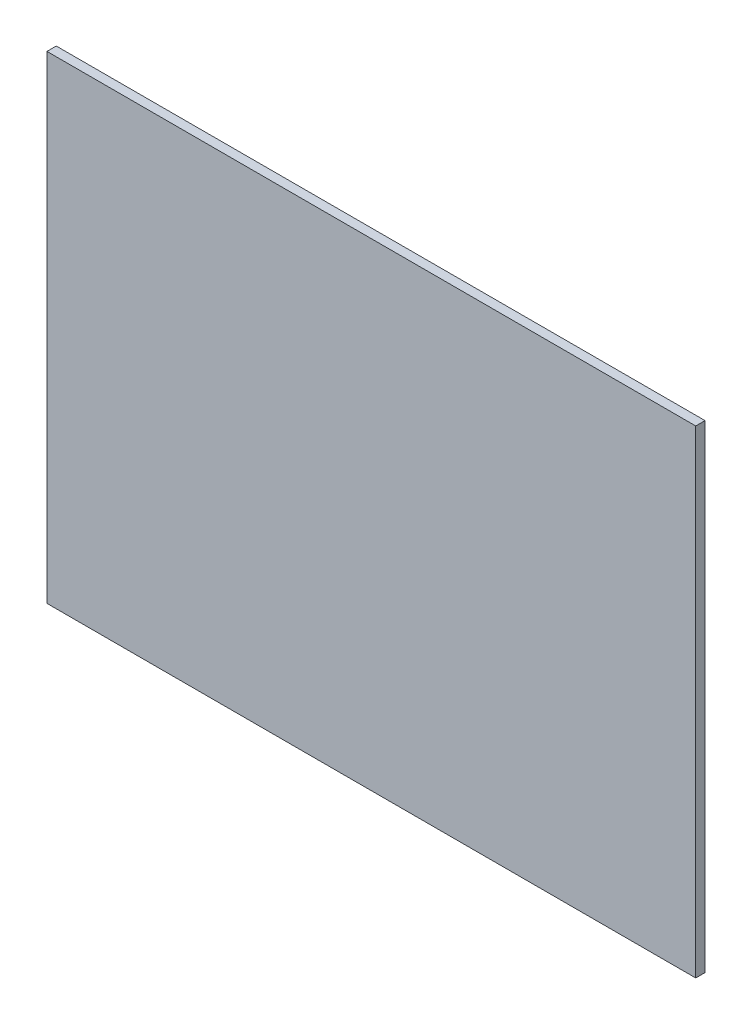
ISO-10303-21;
HEADER;
FILE_DESCRIPTION(('STEP AP214'),'2;1');
FILE_NAME('part.step','',(''),(''),'','','');
FILE_SCHEMA(('AUTOMOTIVE_DESIGN { 1 0 10303 214 1 1 1 1 }'));
ENDSEC;
DATA;
#1=APPLICATION_CONTEXT('core data for automotive mechanical design processes');
#2=APPLICATION_PROTOCOL_DEFINITION('international standard','automotive_design',2000,#1);
#3=PRODUCT_CONTEXT('',#1,'mechanical');
#4=PRODUCT('Part','Part','',(#3));
#5=PRODUCT_RELATED_PRODUCT_CATEGORY('part','',(#4));
#6=PRODUCT_DEFINITION_FORMATION('','',#4);
#7=PRODUCT_DEFINITION_CONTEXT('part definition',#1,'design');
#8=PRODUCT_DEFINITION('design','',#6,#7);
#9=PRODUCT_DEFINITION_SHAPE('','',#8);
#10=(LENGTH_UNIT() NAMED_UNIT(*) SI_UNIT(.MILLI.,.METRE.));
#11=(NAMED_UNIT(*) PLANE_ANGLE_UNIT() SI_UNIT($,.RADIAN.));
#12=(NAMED_UNIT(*) SI_UNIT($,.STERADIAN.) SOLID_ANGLE_UNIT());
#13=UNCERTAINTY_MEASURE_WITH_UNIT(LENGTH_MEASURE(1.E-05),#10,'distance_accuracy_value','');
#14=(GEOMETRIC_REPRESENTATION_CONTEXT(3) GLOBAL_UNCERTAINTY_ASSIGNED_CONTEXT((#13)) GLOBAL_UNIT_ASSIGNED_CONTEXT((#10,
#11,#12)) REPRESENTATION_CONTEXT('',''));
#15=CARTESIAN_POINT('',(0.,0.,0.));
#16=DIRECTION('',(0.,0.,1.));
#17=DIRECTION('',(1.,0.,0.));
#18=AXIS2_PLACEMENT_3D('',#15,#16,#17);
#19=CARTESIAN_POINT('',(0.,0.,6.));
#20=DIRECTION('',(1.,0.,0.));
#21=DIRECTION('',(0.,0.,-1.));
#22=AXIS2_PLACEMENT_3D('',#19,#20,#21);
#23=PLANE('',#22);
#24=DIRECTION('',(0.,-1.,0.));
#25=VECTOR('',#24,1.);
#26=CARTESIAN_POINT('',(0.,0.,0.));
#27=LINE('',#26,#25);
#28=CARTESIAN_POINT('',(0.,308.,0.));
#29=VERTEX_POINT('',#28);
#30=CARTESIAN_POINT('',(0.,0.,0.));
#31=VERTEX_POINT('',#30);
#32=EDGE_CURVE('E96',#29,#31,#27,.T.);
#33=ORIENTED_EDGE('',*,*,#32,.T.);
#34=DIRECTION('',(0.,0.,-1.));
#35=VECTOR('',#34,1.);
#36=CARTESIAN_POINT('',(0.,0.,6.));
#37=LINE('',#36,#35);
#38=CARTESIAN_POINT('',(0.,0.,6.));
#39=VERTEX_POINT('',#38);
#40=EDGE_CURVE('E11',#39,#31,#37,.T.);
#41=ORIENTED_EDGE('',*,*,#40,.F.);
#42=DIRECTION('',(0.,-1.,0.));
#43=VECTOR('',#42,1.);
#44=CARTESIAN_POINT('',(0.,0.,6.));
#45=LINE('',#44,#43);
#46=CARTESIAN_POINT('',(0.,308.,6.));
#47=VERTEX_POINT('',#46);
#48=EDGE_CURVE('E84',#47,#39,#45,.T.);
#49=ORIENTED_EDGE('',*,*,#48,.F.);
#50=DIRECTION('',(0.,0.,-1.));
#51=VECTOR('',#50,1.);
#52=CARTESIAN_POINT('',(0.,308.,6.));
#53=LINE('',#52,#51);
#54=EDGE_CURVE('E92',#47,#29,#53,.T.);
#55=ORIENTED_EDGE('',*,*,#54,.T.);
#56=EDGE_LOOP('',(#33,#41,#49,#55));
#57=FACE_BOUND('',#56,.T.);
#58=ADVANCED_FACE('F33',(#57),#23,.F.);
#59=CARTESIAN_POINT('',(0.,0.,6.));
#60=DIRECTION('',(0.,1.,0.));
#61=DIRECTION('',(0.,0.,1.));
#62=AXIS2_PLACEMENT_3D('',#59,#60,#61);
#63=PLANE('',#62);
#64=DIRECTION('',(1.,0.,0.));
#65=VECTOR('',#64,1.);
#66=CARTESIAN_POINT('',(0.,0.,0.));
#67=LINE('',#66,#65);
#68=CARTESIAN_POINT('',(418.,0.,0.));
#69=VERTEX_POINT('',#68);
#70=EDGE_CURVE('E88',#31,#69,#67,.T.);
#71=ORIENTED_EDGE('',*,*,#70,.T.);
#72=DIRECTION('',(0.,0.,-1.));
#73=VECTOR('',#72,1.);
#74=CARTESIAN_POINT('',(418.,0.,6.));
#75=LINE('',#74,#73);
#76=CARTESIAN_POINT('',(418.,0.,6.));
#77=VERTEX_POINT('',#76);
#78=EDGE_CURVE('E41',#77,#69,#75,.T.);
#79=ORIENTED_EDGE('',*,*,#78,.F.);
#80=DIRECTION('',(1.,0.,0.));
#81=VECTOR('',#80,1.);
#82=CARTESIAN_POINT('',(0.,0.,6.));
#83=LINE('',#82,#81);
#84=EDGE_CURVE('E79',#39,#77,#83,.T.);
#85=ORIENTED_EDGE('',*,*,#84,.F.);
#86=ORIENTED_EDGE('',*,*,#40,.T.);
#87=EDGE_LOOP('',(#71,#79,#85,#86));
#88=FACE_BOUND('',#87,.T.);
#89=ADVANCED_FACE('F87',(#88),#63,.F.);
#90=CARTESIAN_POINT('',(418.,0.,6.));
#91=DIRECTION('',(-1.,0.,0.));
#92=DIRECTION('',(0.,0.,1.));
#93=AXIS2_PLACEMENT_3D('',#90,#91,#92);
#94=PLANE('',#93);
#95=DIRECTION('',(0.,1.,0.));
#96=VECTOR('',#95,1.);
#97=CARTESIAN_POINT('',(418.,0.,0.));
#98=LINE('',#97,#96);
#99=CARTESIAN_POINT('',(418.,308.,0.));
#100=VERTEX_POINT('',#99);
#101=EDGE_CURVE('E66',#69,#100,#98,.T.);
#102=ORIENTED_EDGE('',*,*,#101,.T.);
#103=DIRECTION('',(0.,0.,-1.));
#104=VECTOR('',#103,1.);
#105=CARTESIAN_POINT('',(418.,308.,6.));
#106=LINE('',#105,#104);
#107=CARTESIAN_POINT('',(418.,308.,6.));
#108=VERTEX_POINT('',#107);
#109=EDGE_CURVE('E89',#108,#100,#106,.T.);
#110=ORIENTED_EDGE('',*,*,#109,.F.);
#111=DIRECTION('',(0.,1.,0.));
#112=VECTOR('',#111,1.);
#113=CARTESIAN_POINT('',(418.,0.,6.));
#114=LINE('',#113,#112);
#115=EDGE_CURVE('E82',#77,#108,#114,.T.);
#116=ORIENTED_EDGE('',*,*,#115,.F.);
#117=ORIENTED_EDGE('',*,*,#78,.T.);
#118=EDGE_LOOP('',(#102,#110,#116,#117));
#119=FACE_BOUND('',#118,.T.);
#120=ADVANCED_FACE('F90',(#119),#94,.F.);
#121=CARTESIAN_POINT('',(0.,308.,6.));
#122=DIRECTION('',(0.,-1.,0.));
#123=DIRECTION('',(0.,0.,-1.));
#124=AXIS2_PLACEMENT_3D('',#121,#122,#123);
#125=PLANE('',#124);
#126=DIRECTION('',(-1.,0.,0.));
#127=VECTOR('',#126,1.);
#128=CARTESIAN_POINT('',(0.,308.,0.));
#129=LINE('',#128,#127);
#130=EDGE_CURVE('E72',#100,#29,#129,.T.);
#131=ORIENTED_EDGE('',*,*,#130,.T.);
#132=ORIENTED_EDGE('',*,*,#54,.F.);
#133=DIRECTION('',(-1.,0.,0.));
#134=VECTOR('',#133,1.);
#135=CARTESIAN_POINT('',(0.,308.,6.));
#136=LINE('',#135,#134);
#137=EDGE_CURVE('E49',#108,#47,#136,.T.);
#138=ORIENTED_EDGE('',*,*,#137,.F.);
#139=ORIENTED_EDGE('',*,*,#109,.T.);
#140=EDGE_LOOP('',(#131,#132,#138,#139));
#141=FACE_BOUND('',#140,.T.);
#142=ADVANCED_FACE('F103',(#141),#125,.F.);
#143=CARTESIAN_POINT('',(0.,0.,6.));
#144=DIRECTION('',(0.,0.,-1.));
#145=DIRECTION('',(-1.,0.,0.));
#146=AXIS2_PLACEMENT_3D('',#143,#144,#145);
#147=PLANE('',#146);
#148=ORIENTED_EDGE('',*,*,#48,.T.);
#149=ORIENTED_EDGE('',*,*,#84,.T.);
#150=ORIENTED_EDGE('',*,*,#115,.T.);
#151=ORIENTED_EDGE('',*,*,#137,.T.);
#152=EDGE_LOOP('',(#148,#149,#150,#151));
#153=FACE_BOUND('',#152,.T.);
#154=ADVANCED_FACE('F80',(#153),#147,.F.);
#155=CARTESIAN_POINT('',(0.,0.,0.));
#156=DIRECTION('',(0.,0.,-1.));
#157=DIRECTION('',(-1.,0.,0.));
#158=AXIS2_PLACEMENT_3D('',#155,#156,#157);
#159=PLANE('',#158);
#160=ORIENTED_EDGE('',*,*,#32,.F.);
#161=ORIENTED_EDGE('',*,*,#130,.F.);
#162=ORIENTED_EDGE('',*,*,#101,.F.);
#163=ORIENTED_EDGE('',*,*,#70,.F.);
#164=EDGE_LOOP('',(#160,#161,#162,#163));
#165=FACE_BOUND('',#164,.T.);
#166=ADVANCED_FACE('F106',(#165),#159,.T.);
#167=CLOSED_SHELL('',(#58,#89,#120,#142,#154,#166));
#168=MANIFOLD_SOLID_BREP('B2',#167);
#169=ADVANCED_BREP_SHAPE_REPRESENTATION('',(#18,#168),#14);
#170=SHAPE_DEFINITION_REPRESENTATION(#9,#169);
ENDSEC;
END-ISO-10303-21;
